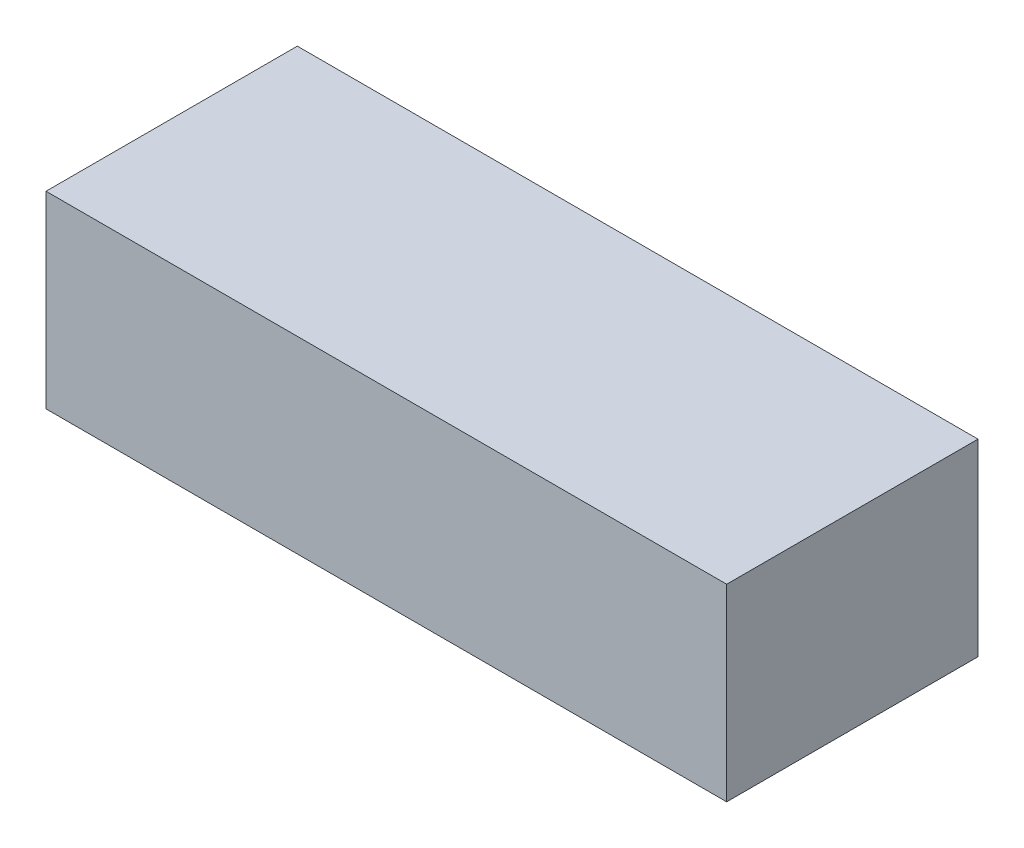
ISO-10303-21;
HEADER;
FILE_DESCRIPTION(('STEP AP214'),'2;1');
FILE_NAME('part.step','',(''),(''),'','','');
FILE_SCHEMA(('AUTOMOTIVE_DESIGN { 1 0 10303 214 1 1 1 1 }'));
ENDSEC;
DATA;
#1=APPLICATION_CONTEXT('core data for automotive mechanical design processes');
#2=APPLICATION_PROTOCOL_DEFINITION('international standard','automotive_design',2000,#1);
#3=PRODUCT_CONTEXT('',#1,'mechanical');
#4=PRODUCT('Part','Part','',(#3));
#5=PRODUCT_RELATED_PRODUCT_CATEGORY('part','',(#4));
#6=PRODUCT_DEFINITION_FORMATION('','',#4);
#7=PRODUCT_DEFINITION_CONTEXT('part definition',#1,'design');
#8=PRODUCT_DEFINITION('design','',#6,#7);
#9=PRODUCT_DEFINITION_SHAPE('','',#8);
#10=(LENGTH_UNIT() NAMED_UNIT(*) SI_UNIT(.MILLI.,.METRE.));
#11=(NAMED_UNIT(*) PLANE_ANGLE_UNIT() SI_UNIT($,.RADIAN.));
#12=(NAMED_UNIT(*) SI_UNIT($,.STERADIAN.) SOLID_ANGLE_UNIT());
#13=UNCERTAINTY_MEASURE_WITH_UNIT(LENGTH_MEASURE(1.E-05),#10,'distance_accuracy_value','');
#14=(GEOMETRIC_REPRESENTATION_CONTEXT(3) GLOBAL_UNCERTAINTY_ASSIGNED_CONTEXT((#13)) GLOBAL_UNIT_ASSIGNED_CONTEXT((#10,
#11,#12)) REPRESENTATION_CONTEXT('',''));
#15=CARTESIAN_POINT('',(0.,0.,0.));
#16=DIRECTION('',(0.,0.,1.));
#17=DIRECTION('',(1.,0.,0.));
#18=AXIS2_PLACEMENT_3D('',#15,#16,#17);
#19=CARTESIAN_POINT('',(65.,-9.,-12.));
#20=DIRECTION('',(0.,0.,1.));
#21=DIRECTION('',(1.,0.,0.));
#22=AXIS2_PLACEMENT_3D('',#19,#20,#21);
#23=PLANE('',#22);
#24=DIRECTION('',(0.,1.,0.));
#25=VECTOR('',#24,1.);
#26=CARTESIAN_POINT('',(0.,-9.,-12.));
#27=LINE('',#26,#25);
#28=CARTESIAN_POINT('',(0.,-9.,-12.));
#29=VERTEX_POINT('',#28);
#30=CARTESIAN_POINT('',(0.,9.,-12.));
#31=VERTEX_POINT('',#30);
#32=EDGE_CURVE('E107',#29,#31,#27,.T.);
#33=ORIENTED_EDGE('',*,*,#32,.T.);
#34=DIRECTION('',(-1.,0.,0.));
#35=VECTOR('',#34,1.);
#36=CARTESIAN_POINT('',(65.,9.,-12.));
#37=LINE('',#36,#35);
#38=CARTESIAN_POINT('',(65.,9.,-12.));
#39=VERTEX_POINT('',#38);
#40=EDGE_CURVE('E11',#39,#31,#37,.T.);
#41=ORIENTED_EDGE('',*,*,#40,.F.);
#42=DIRECTION('',(0.,1.,0.));
#43=VECTOR('',#42,1.);
#44=CARTESIAN_POINT('',(65.,-9.,-12.));
#45=LINE('',#44,#43);
#46=CARTESIAN_POINT('',(65.,-9.,-12.));
#47=VERTEX_POINT('',#46);
#48=EDGE_CURVE('E91',#47,#39,#45,.T.);
#49=ORIENTED_EDGE('',*,*,#48,.F.);
#50=DIRECTION('',(-1.,0.,0.));
#51=VECTOR('',#50,1.);
#52=CARTESIAN_POINT('',(65.,-9.,-12.));
#53=LINE('',#52,#51);
#54=EDGE_CURVE('E103',#47,#29,#53,.T.);
#55=ORIENTED_EDGE('',*,*,#54,.T.);
#56=EDGE_LOOP('',(#33,#41,#49,#55));
#57=FACE_BOUND('',#56,.T.);
#58=ADVANCED_FACE('F39',(#57),#23,.F.);
#59=CARTESIAN_POINT('',(65.,8.99999999999999,12.));
#60=DIRECTION('',(0.,-1.,0.));
#61=DIRECTION('',(0.,0.,-1.));
#62=AXIS2_PLACEMENT_3D('',#59,#60,#61);
#63=PLANE('',#62);
#64=DIRECTION('',(0.,0.,1.));
#65=VECTOR('',#64,1.);
#66=CARTESIAN_POINT('',(0.,8.99999999999999,12.));
#67=LINE('',#66,#65);
#68=CARTESIAN_POINT('',(0.,8.99999999999999,12.));
#69=VERTEX_POINT('',#68);
#70=EDGE_CURVE('E96',#31,#69,#67,.T.);
#71=ORIENTED_EDGE('',*,*,#70,.T.);
#72=DIRECTION('',(-1.,0.,0.));
#73=VECTOR('',#72,1.);
#74=CARTESIAN_POINT('',(65.,8.99999999999999,12.));
#75=LINE('',#74,#73);
#76=CARTESIAN_POINT('',(65.,8.99999999999999,12.));
#77=VERTEX_POINT('',#76);
#78=EDGE_CURVE('E48',#77,#69,#75,.T.);
#79=ORIENTED_EDGE('',*,*,#78,.F.);
#80=DIRECTION('',(0.,0.,1.));
#81=VECTOR('',#80,1.);
#82=CARTESIAN_POINT('',(65.,8.99999999999999,12.));
#83=LINE('',#82,#81);
#84=EDGE_CURVE('E86',#39,#77,#83,.T.);
#85=ORIENTED_EDGE('',*,*,#84,.F.);
#86=ORIENTED_EDGE('',*,*,#40,.T.);
#87=EDGE_LOOP('',(#71,#79,#85,#86));
#88=FACE_BOUND('',#87,.T.);
#89=ADVANCED_FACE('F95',(#88),#63,.F.);
#90=CARTESIAN_POINT('',(65.,-9.,12.));
#91=DIRECTION('',(0.,0.,-1.));
#92=DIRECTION('',(0.,1.,0.));
#93=AXIS2_PLACEMENT_3D('',#90,#91,#92);
#94=PLANE('',#93);
#95=DIRECTION('',(0.,-1.,0.));
#96=VECTOR('',#95,1.);
#97=CARTESIAN_POINT('',(0.,-9.,12.));
#98=LINE('',#97,#96);
#99=CARTESIAN_POINT('',(0.,-9.,12.));
#100=VERTEX_POINT('',#99);
#101=EDGE_CURVE('E73',#69,#100,#98,.T.);
#102=ORIENTED_EDGE('',*,*,#101,.T.);
#103=DIRECTION('',(-1.,0.,0.));
#104=VECTOR('',#103,1.);
#105=CARTESIAN_POINT('',(65.,-9.,12.));
#106=LINE('',#105,#104);
#107=CARTESIAN_POINT('',(65.,-9.,12.));
#108=VERTEX_POINT('',#107);
#109=EDGE_CURVE('E98',#108,#100,#106,.T.);
#110=ORIENTED_EDGE('',*,*,#109,.F.);
#111=DIRECTION('',(0.,-1.,0.));
#112=VECTOR('',#111,1.);
#113=CARTESIAN_POINT('',(65.,-9.,12.));
#114=LINE('',#113,#112);
#115=EDGE_CURVE('E89',#77,#108,#114,.T.);
#116=ORIENTED_EDGE('',*,*,#115,.F.);
#117=ORIENTED_EDGE('',*,*,#78,.T.);
#118=EDGE_LOOP('',(#102,#110,#116,#117));
#119=FACE_BOUND('',#118,.T.);
#120=ADVANCED_FACE('F99',(#119),#94,.F.);
#121=CARTESIAN_POINT('',(65.,-9.,12.));
#122=DIRECTION('',(0.,1.,0.));
#123=DIRECTION('',(0.,0.,1.));
#124=AXIS2_PLACEMENT_3D('',#121,#122,#123);
#125=PLANE('',#124);
#126=DIRECTION('',(0.,0.,-1.));
#127=VECTOR('',#126,1.);
#128=CARTESIAN_POINT('',(0.,-9.,12.));
#129=LINE('',#128,#127);
#130=EDGE_CURVE('E79',#100,#29,#129,.T.);
#131=ORIENTED_EDGE('',*,*,#130,.T.);
#132=ORIENTED_EDGE('',*,*,#54,.F.);
#133=DIRECTION('',(0.,0.,-1.));
#134=VECTOR('',#133,1.);
#135=CARTESIAN_POINT('',(65.,-9.,12.));
#136=LINE('',#135,#134);
#137=EDGE_CURVE('E56',#108,#47,#136,.T.);
#138=ORIENTED_EDGE('',*,*,#137,.F.);
#139=ORIENTED_EDGE('',*,*,#109,.T.);
#140=EDGE_LOOP('',(#131,#132,#138,#139));
#141=FACE_BOUND('',#140,.T.);
#142=ADVANCED_FACE('F120',(#141),#125,.F.);
#143=CARTESIAN_POINT('',(65.,0.,0.));
#144=DIRECTION('',(-1.,0.,0.));
#145=DIRECTION('',(0.,0.,1.));
#146=AXIS2_PLACEMENT_3D('',#143,#144,#145);
#147=PLANE('',#146);
#148=ORIENTED_EDGE('',*,*,#48,.T.);
#149=ORIENTED_EDGE('',*,*,#84,.T.);
#150=ORIENTED_EDGE('',*,*,#115,.T.);
#151=ORIENTED_EDGE('',*,*,#137,.T.);
#152=EDGE_LOOP('',(#148,#149,#150,#151));
#153=FACE_BOUND('',#152,.T.);
#154=ADVANCED_FACE('F87',(#153),#147,.F.);
#155=CARTESIAN_POINT('',(0.,0.,0.));
#156=DIRECTION('',(-1.,0.,0.));
#157=DIRECTION('',(0.,0.,1.));
#158=AXIS2_PLACEMENT_3D('',#155,#156,#157);
#159=PLANE('',#158);
#160=ORIENTED_EDGE('',*,*,#32,.F.);
#161=ORIENTED_EDGE('',*,*,#130,.F.);
#162=ORIENTED_EDGE('',*,*,#101,.F.);
#163=ORIENTED_EDGE('',*,*,#70,.F.);
#164=EDGE_LOOP('',(#160,#161,#162,#163));
#165=FACE_BOUND('',#164,.T.);
#166=ADVANCED_FACE('F123',(#165),#159,.T.);
#167=CLOSED_SHELL('',(#58,#89,#120,#142,#154,#166));
#168=MANIFOLD_SOLID_BREP('B2',#167);
#169=ADVANCED_BREP_SHAPE_REPRESENTATION('',(#18,#168),#14);
#170=SHAPE_DEFINITION_REPRESENTATION(#9,#169);
ENDSEC;
END-ISO-10303-21;
